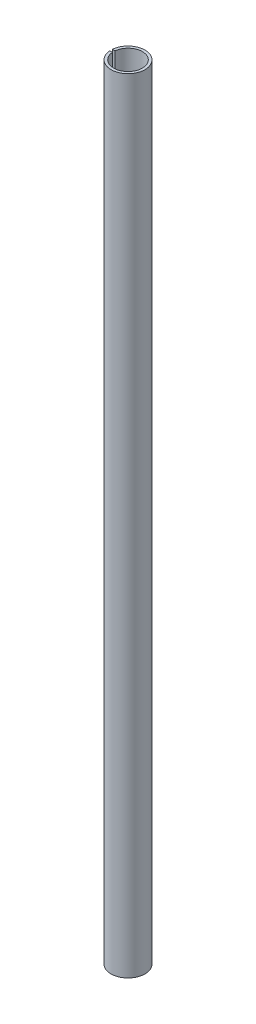
ISO-10303-21;
HEADER;
FILE_DESCRIPTION(('STEP AP214'),'2;1');
FILE_NAME('part.step','',(''),(''),'','','');
FILE_SCHEMA(('AUTOMOTIVE_DESIGN { 1 0 10303 214 1 1 1 1 }'));
ENDSEC;
DATA;
#1=APPLICATION_CONTEXT('core data for automotive mechanical design processes');
#2=APPLICATION_PROTOCOL_DEFINITION('international standard','automotive_design',2000,#1);
#3=PRODUCT_CONTEXT('',#1,'mechanical');
#4=PRODUCT('Part','Part','',(#3));
#5=PRODUCT_RELATED_PRODUCT_CATEGORY('part','',(#4));
#6=PRODUCT_DEFINITION_FORMATION('','',#4);
#7=PRODUCT_DEFINITION_CONTEXT('part definition',#1,'design');
#8=PRODUCT_DEFINITION('design','',#6,#7);
#9=PRODUCT_DEFINITION_SHAPE('','',#8);
#10=(LENGTH_UNIT() NAMED_UNIT(*) SI_UNIT(.MILLI.,.METRE.));
#11=(NAMED_UNIT(*) PLANE_ANGLE_UNIT() SI_UNIT($,.RADIAN.));
#12=(NAMED_UNIT(*) SI_UNIT($,.STERADIAN.) SOLID_ANGLE_UNIT());
#13=UNCERTAINTY_MEASURE_WITH_UNIT(LENGTH_MEASURE(1.E-05),#10,'distance_accuracy_value','');
#14=(GEOMETRIC_REPRESENTATION_CONTEXT(3) GLOBAL_UNCERTAINTY_ASSIGNED_CONTEXT((#13)) GLOBAL_UNIT_ASSIGNED_CONTEXT((#10,
#11,#12)) REPRESENTATION_CONTEXT('',''));
#15=CARTESIAN_POINT('',(0.,0.,0.));
#16=DIRECTION('',(0.,0.,1.));
#17=DIRECTION('',(1.,0.,0.));
#18=AXIS2_PLACEMENT_3D('',#15,#16,#17);
#19=CARTESIAN_POINT('',(0.,600.,0.));
#20=DIRECTION('',(0.,1.,0.));
#21=DIRECTION('',(0.,0.,1.));
#22=AXIS2_PLACEMENT_3D('',#19,#20,#21);
#23=PLANE('',#22);
#24=DIRECTION('',(1.,0.,0.));
#25=VECTOR('',#24,1.);
#26=CARTESIAN_POINT('',(-13.,600.,1.));
#27=LINE('',#26,#25);
#28=CARTESIAN_POINT('',(-12.9614813968157,600.,1.));
#29=VERTEX_POINT('',#28);
#30=CARTESIAN_POINT('',(-10.9544511501033,600.,1.));
#31=VERTEX_POINT('',#30);
#32=EDGE_CURVE('E156',#29,#31,#27,.T.);
#33=ORIENTED_EDGE('',*,*,#32,.F.);
#34=CARTESIAN_POINT('',(0.,600.,0.));
#35=DIRECTION('',(0.,1.,0.));
#36=DIRECTION('',(0.,0.,1.));
#37=AXIS2_PLACEMENT_3D('',#34,#35,#36);
#38=CIRCLE('',#37,13.);
#39=CARTESIAN_POINT('',(-12.9614813968157,600.,-1.));
#40=VERTEX_POINT('',#39);
#41=EDGE_CURVE('E118',#29,#40,#38,.T.);
#42=ORIENTED_EDGE('',*,*,#41,.T.);
#43=DIRECTION('',(1.,0.,0.));
#44=VECTOR('',#43,1.);
#45=CARTESIAN_POINT('',(-13.,600.,-1.));
#46=LINE('',#45,#44);
#47=CARTESIAN_POINT('',(-10.9544511501033,600.,-1.));
#48=VERTEX_POINT('',#47);
#49=EDGE_CURVE('E161',#40,#48,#46,.T.);
#50=ORIENTED_EDGE('',*,*,#49,.T.);
#51=CARTESIAN_POINT('',(0.,600.,0.));
#52=DIRECTION('',(0.,1.,0.));
#53=DIRECTION('',(0.,0.,1.));
#54=AXIS2_PLACEMENT_3D('',#51,#52,#53);
#55=CIRCLE('',#54,11.);
#56=EDGE_CURVE('E119',#31,#48,#55,.T.);
#57=ORIENTED_EDGE('',*,*,#56,.F.);
#58=EDGE_LOOP('',(#33,#42,#50,#57));
#59=FACE_BOUND('',#58,.T.);
#60=ADVANCED_FACE('F35',(#59),#23,.T.);
#61=CARTESIAN_POINT('',(0.,0.,0.));
#62=DIRECTION('',(0.,1.,0.));
#63=DIRECTION('',(0.,0.,1.));
#64=AXIS2_PLACEMENT_3D('',#61,#62,#63);
#65=PLANE('',#64);
#66=CARTESIAN_POINT('',(0.,0.,0.));
#67=DIRECTION('',(0.,1.,0.));
#68=DIRECTION('',(0.,0.,1.));
#69=AXIS2_PLACEMENT_3D('',#66,#67,#68);
#70=CIRCLE('',#69,13.);
#71=CARTESIAN_POINT('',(-12.9614813968157,0.,1.));
#72=VERTEX_POINT('',#71);
#73=CARTESIAN_POINT('',(-12.9614813968157,0.,-1.));
#74=VERTEX_POINT('',#73);
#75=EDGE_CURVE('E114',#72,#74,#70,.T.);
#76=ORIENTED_EDGE('',*,*,#75,.F.);
#77=DIRECTION('',(1.,0.,0.));
#78=VECTOR('',#77,1.);
#79=CARTESIAN_POINT('',(-13.,0.,1.));
#80=LINE('',#79,#78);
#81=CARTESIAN_POINT('',(-10.9544511501033,0.,1.));
#82=VERTEX_POINT('',#81);
#83=EDGE_CURVE('E99',#72,#82,#80,.T.);
#84=ORIENTED_EDGE('',*,*,#83,.T.);
#85=CARTESIAN_POINT('',(0.,0.,0.));
#86=DIRECTION('',(0.,1.,0.));
#87=DIRECTION('',(0.,0.,1.));
#88=AXIS2_PLACEMENT_3D('',#85,#86,#87);
#89=CIRCLE('',#88,11.);
#90=CARTESIAN_POINT('',(-10.9544511501033,0.,-1.));
#91=VERTEX_POINT('',#90);
#92=EDGE_CURVE('E125',#82,#91,#89,.T.);
#93=ORIENTED_EDGE('',*,*,#92,.T.);
#94=DIRECTION('',(1.,0.,0.));
#95=VECTOR('',#94,1.);
#96=CARTESIAN_POINT('',(-13.,0.,-1.));
#97=LINE('',#96,#95);
#98=EDGE_CURVE('E50',#74,#91,#97,.T.);
#99=ORIENTED_EDGE('',*,*,#98,.F.);
#100=EDGE_LOOP('',(#76,#84,#93,#99));
#101=FACE_BOUND('',#100,.T.);
#102=ADVANCED_FACE('F117',(#101),#65,.F.);
#103=CARTESIAN_POINT('',(0.,600.,0.));
#104=DIRECTION('',(0.,-1.,0.));
#105=DIRECTION('',(0.,0.,-1.));
#106=AXIS2_PLACEMENT_3D('',#103,#104,#105);
#107=CYLINDRICAL_SURFACE('',#106,13.);
#108=ORIENTED_EDGE('',*,*,#41,.F.);
#109=DIRECTION('',(0.,-1.,0.));
#110=VECTOR('',#109,1.);
#111=CARTESIAN_POINT('',(-12.9614813968157,600.,1.));
#112=LINE('',#111,#110);
#113=CARTESIAN_POINT('',(-12.9614813968157,570.,0.999999999999996));
#114=VERTEX_POINT('',#113);
#115=EDGE_CURVE('E147',#29,#114,#112,.T.);
#116=ORIENTED_EDGE('',*,*,#115,.T.);
#117=CARTESIAN_POINT('',(0.,570.,0.));
#118=DIRECTION('',(0.,-1.,0.));
#119=DIRECTION('',(0.,0.,-1.));
#120=AXIS2_PLACEMENT_3D('',#117,#118,#119);
#121=CIRCLE('',#120,13.);
#122=CARTESIAN_POINT('',(-12.9614813968157,570.,-1.));
#123=VERTEX_POINT('',#122);
#124=EDGE_CURVE('E154',#114,#123,#121,.T.);
#125=ORIENTED_EDGE('',*,*,#124,.T.);
#126=DIRECTION('',(0.,-1.,0.));
#127=VECTOR('',#126,1.);
#128=CARTESIAN_POINT('',(-12.9614813968157,600.,-1.));
#129=LINE('',#128,#127);
#130=EDGE_CURVE('E149',#123,#40,#129,.F.);
#131=ORIENTED_EDGE('',*,*,#130,.T.);
#132=EDGE_LOOP('',(#108,#116,#125,#131));
#133=FACE_BOUND('',#132,.T.);
#134=DIRECTION('',(0.,-1.,0.));
#135=VECTOR('',#134,1.);
#136=CARTESIAN_POINT('',(-12.9614813968157,600.,-0.999999999999919));
#137=LINE('',#136,#135);
#138=CARTESIAN_POINT('',(-12.9614813968157,30.,-0.999999999999997));
#139=VERTEX_POINT('',#138);
#140=EDGE_CURVE('E143',#74,#139,#137,.F.);
#141=ORIENTED_EDGE('',*,*,#140,.T.);
#142=CARTESIAN_POINT('',(0.,30.,0.));
#143=DIRECTION('',(0.,1.,0.));
#144=DIRECTION('',(0.,0.,1.));
#145=AXIS2_PLACEMENT_3D('',#142,#143,#144);
#146=CIRCLE('',#145,13.);
#147=CARTESIAN_POINT('',(-12.9614813968157,30.,1.));
#148=VERTEX_POINT('',#147);
#149=EDGE_CURVE('E115',#139,#148,#146,.T.);
#150=ORIENTED_EDGE('',*,*,#149,.T.);
#151=DIRECTION('',(0.,-1.,0.));
#152=VECTOR('',#151,1.);
#153=CARTESIAN_POINT('',(-12.9614813968157,600.,1.00000000000005));
#154=LINE('',#153,#152);
#155=EDGE_CURVE('E103',#148,#72,#154,.T.);
#156=ORIENTED_EDGE('',*,*,#155,.T.);
#157=ORIENTED_EDGE('',*,*,#75,.T.);
#158=EDGE_LOOP('',(#141,#150,#156,#157));
#159=FACE_BOUND('',#158,.T.);
#160=ADVANCED_FACE('F37',(#133,#159),#107,.T.);
#161=CARTESIAN_POINT('',(0.,600.,0.));
#162=DIRECTION('',(0.,-1.,0.));
#163=DIRECTION('',(0.,0.,-1.));
#164=AXIS2_PLACEMENT_3D('',#161,#162,#163);
#165=CYLINDRICAL_SURFACE('',#164,11.);
#166=DIRECTION('',(0.,-1.,0.));
#167=VECTOR('',#166,1.);
#168=CARTESIAN_POINT('',(-10.9544511501033,600.,1.00000000000005));
#169=LINE('',#168,#167);
#170=CARTESIAN_POINT('',(-10.9544511501033,30.,1.));
#171=VERTEX_POINT('',#170);
#172=EDGE_CURVE('E11',#171,#82,#169,.T.);
#173=ORIENTED_EDGE('',*,*,#172,.F.);
#174=CARTESIAN_POINT('',(0.,30.,0.));
#175=DIRECTION('',(0.,1.,0.));
#176=DIRECTION('',(0.,0.,1.));
#177=AXIS2_PLACEMENT_3D('',#174,#175,#176);
#178=CIRCLE('',#177,11.);
#179=CARTESIAN_POINT('',(-10.9544511501033,30.,-0.999999999999997));
#180=VERTEX_POINT('',#179);
#181=EDGE_CURVE('E43',#180,#171,#178,.T.);
#182=ORIENTED_EDGE('',*,*,#181,.F.);
#183=DIRECTION('',(0.,-1.,0.));
#184=VECTOR('',#183,1.);
#185=CARTESIAN_POINT('',(-10.9544511501033,600.,-0.999999999999919));
#186=LINE('',#185,#184);
#187=EDGE_CURVE('E134',#91,#180,#186,.F.);
#188=ORIENTED_EDGE('',*,*,#187,.F.);
#189=ORIENTED_EDGE('',*,*,#92,.F.);
#190=EDGE_LOOP('',(#173,#182,#188,#189));
#191=FACE_BOUND('',#190,.T.);
#192=DIRECTION('',(0.,-1.,0.));
#193=VECTOR('',#192,1.);
#194=CARTESIAN_POINT('',(-10.9544511501033,600.,1.));
#195=LINE('',#194,#193);
#196=CARTESIAN_POINT('',(-10.9544511501033,570.,0.999999999999996));
#197=VERTEX_POINT('',#196);
#198=EDGE_CURVE('E132',#31,#197,#195,.T.);
#199=ORIENTED_EDGE('',*,*,#198,.F.);
#200=ORIENTED_EDGE('',*,*,#56,.T.);
#201=DIRECTION('',(0.,-1.,0.));
#202=VECTOR('',#201,1.);
#203=CARTESIAN_POINT('',(-10.9544511501033,600.,-1.));
#204=LINE('',#203,#202);
#205=CARTESIAN_POINT('',(-10.9544511501033,570.,-1.));
#206=VERTEX_POINT('',#205);
#207=EDGE_CURVE('E130',#206,#48,#204,.F.);
#208=ORIENTED_EDGE('',*,*,#207,.F.);
#209=CARTESIAN_POINT('',(0.,570.,0.));
#210=DIRECTION('',(0.,-1.,0.));
#211=DIRECTION('',(0.,0.,-1.));
#212=AXIS2_PLACEMENT_3D('',#209,#210,#211);
#213=CIRCLE('',#212,11.);
#214=EDGE_CURVE('E122',#197,#206,#213,.T.);
#215=ORIENTED_EDGE('',*,*,#214,.F.);
#216=EDGE_LOOP('',(#199,#200,#208,#215));
#217=FACE_BOUND('',#216,.T.);
#218=ADVANCED_FACE('F145',(#191,#217),#165,.F.);
#219=CARTESIAN_POINT('',(-13.,600.,1.));
#220=DIRECTION('',(0.,0.,1.));
#221=DIRECTION('',(0.,-1.,0.));
#222=AXIS2_PLACEMENT_3D('',#219,#220,#221);
#223=PLANE('',#222);
#224=ORIENTED_EDGE('',*,*,#32,.T.);
#225=ORIENTED_EDGE('',*,*,#198,.T.);
#226=DIRECTION('',(1.,0.,0.));
#227=VECTOR('',#226,1.);
#228=CARTESIAN_POINT('',(-13.,570.,0.999999999999996));
#229=LINE('',#228,#227);
#230=EDGE_CURVE('E58',#114,#197,#229,.T.);
#231=ORIENTED_EDGE('',*,*,#230,.F.);
#232=ORIENTED_EDGE('',*,*,#115,.F.);
#233=EDGE_LOOP('',(#224,#225,#231,#232));
#234=FACE_BOUND('',#233,.T.);
#235=ADVANCED_FACE('F186',(#234),#223,.F.);
#236=CARTESIAN_POINT('',(-13.,600.,-1.));
#237=DIRECTION('',(0.,0.,-1.));
#238=DIRECTION('',(0.,1.,0.));
#239=AXIS2_PLACEMENT_3D('',#236,#237,#238);
#240=PLANE('',#239);
#241=DIRECTION('',(1.,0.,0.));
#242=VECTOR('',#241,1.);
#243=CARTESIAN_POINT('',(-13.,570.,-1.));
#244=LINE('',#243,#242);
#245=EDGE_CURVE('E158',#123,#206,#244,.T.);
#246=ORIENTED_EDGE('',*,*,#245,.T.);
#247=ORIENTED_EDGE('',*,*,#207,.T.);
#248=ORIENTED_EDGE('',*,*,#49,.F.);
#249=ORIENTED_EDGE('',*,*,#130,.F.);
#250=EDGE_LOOP('',(#246,#247,#248,#249));
#251=FACE_BOUND('',#250,.T.);
#252=ADVANCED_FACE('F189',(#251),#240,.F.);
#253=CARTESIAN_POINT('',(-13.,570.,0.999999999999996));
#254=DIRECTION('',(0.,-1.,0.));
#255=DIRECTION('',(0.,0.,-1.));
#256=AXIS2_PLACEMENT_3D('',#253,#254,#255);
#257=PLANE('',#256);
#258=ORIENTED_EDGE('',*,*,#230,.T.);
#259=ORIENTED_EDGE('',*,*,#214,.T.);
#260=ORIENTED_EDGE('',*,*,#245,.F.);
#261=ORIENTED_EDGE('',*,*,#124,.F.);
#262=EDGE_LOOP('',(#258,#259,#260,#261));
#263=FACE_BOUND('',#262,.T.);
#264=ADVANCED_FACE('F191',(#263),#257,.F.);
#265=CARTESIAN_POINT('',(-13.,30.,1.));
#266=DIRECTION('',(0.,0.,1.));
#267=DIRECTION('',(0.,-1.,0.));
#268=AXIS2_PLACEMENT_3D('',#265,#266,#267);
#269=PLANE('',#268);
#270=DIRECTION('',(1.,0.,0.));
#271=VECTOR('',#270,1.);
#272=CARTESIAN_POINT('',(-13.,30.,1.));
#273=LINE('',#272,#271);
#274=EDGE_CURVE('E139',#148,#171,#273,.T.);
#275=ORIENTED_EDGE('',*,*,#274,.T.);
#276=ORIENTED_EDGE('',*,*,#172,.T.);
#277=ORIENTED_EDGE('',*,*,#83,.F.);
#278=ORIENTED_EDGE('',*,*,#155,.F.);
#279=EDGE_LOOP('',(#275,#276,#277,#278));
#280=FACE_BOUND('',#279,.T.);
#281=ADVANCED_FACE('F102',(#280),#269,.F.);
#282=CARTESIAN_POINT('',(-13.,30.,1.));
#283=DIRECTION('',(0.,1.,0.));
#284=DIRECTION('',(0.,0.,1.));
#285=AXIS2_PLACEMENT_3D('',#282,#283,#284);
#286=PLANE('',#285);
#287=DIRECTION('',(1.,0.,0.));
#288=VECTOR('',#287,1.);
#289=CARTESIAN_POINT('',(-13.,30.,-0.999999999999997));
#290=LINE('',#289,#288);
#291=EDGE_CURVE('E141',#139,#180,#290,.T.);
#292=ORIENTED_EDGE('',*,*,#291,.T.);
#293=ORIENTED_EDGE('',*,*,#181,.T.);
#294=ORIENTED_EDGE('',*,*,#274,.F.);
#295=ORIENTED_EDGE('',*,*,#149,.F.);
#296=EDGE_LOOP('',(#292,#293,#294,#295));
#297=FACE_BOUND('',#296,.T.);
#298=ADVANCED_FACE('F138',(#297),#286,.F.);
#299=CARTESIAN_POINT('',(-13.,30.,-0.999999999999997));
#300=DIRECTION('',(0.,0.,-1.));
#301=DIRECTION('',(0.,1.,0.));
#302=AXIS2_PLACEMENT_3D('',#299,#300,#301);
#303=PLANE('',#302);
#304=ORIENTED_EDGE('',*,*,#98,.T.);
#305=ORIENTED_EDGE('',*,*,#187,.T.);
#306=ORIENTED_EDGE('',*,*,#291,.F.);
#307=ORIENTED_EDGE('',*,*,#140,.F.);
#308=EDGE_LOOP('',(#304,#305,#306,#307));
#309=FACE_BOUND('',#308,.T.);
#310=ADVANCED_FACE('F168',(#309),#303,.F.);
#311=CLOSED_SHELL('',(#60,#102,#160,#218,#235,#252,#264,#281,#298,#310));
#312=MANIFOLD_SOLID_BREP('B2',#311);
#313=ADVANCED_BREP_SHAPE_REPRESENTATION('',(#18,#312),#14);
#314=SHAPE_DEFINITION_REPRESENTATION(#9,#313);
ENDSEC;
END-ISO-10303-21;
